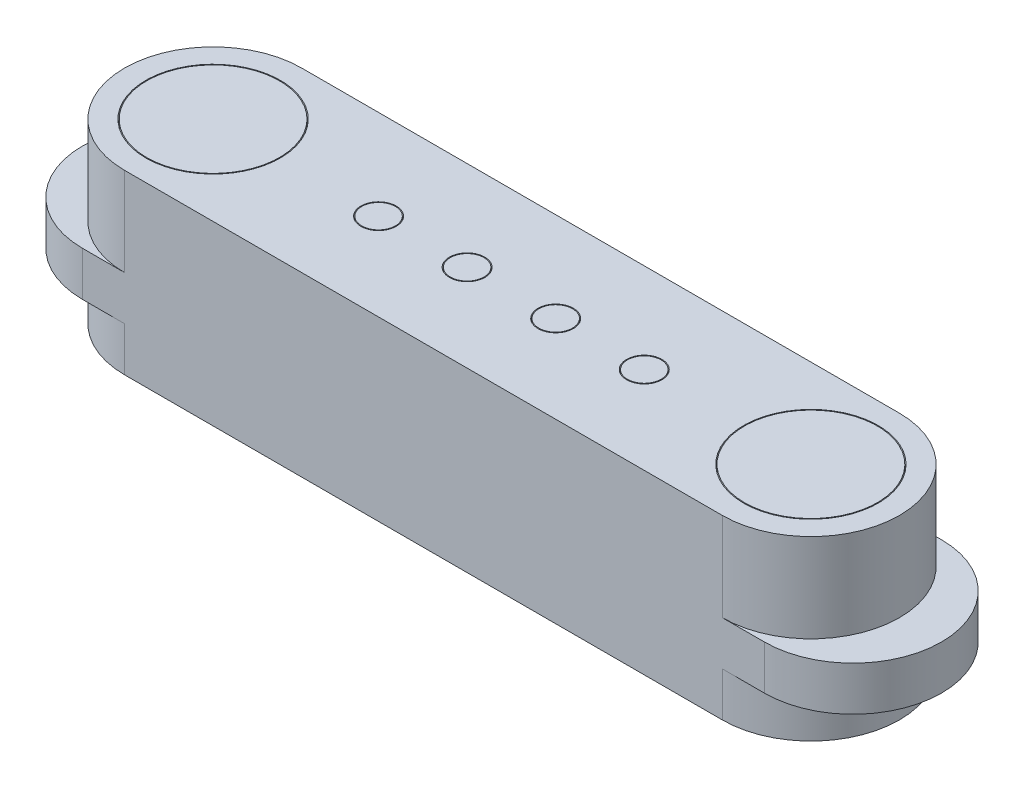
ISO-10303-21;
HEADER;
FILE_DESCRIPTION(('STEP AP214'),'2;1');
FILE_NAME('part.step','',(''),(''),'','','');
FILE_SCHEMA(('AUTOMOTIVE_DESIGN { 1 0 10303 214 1 1 1 1 }'));
ENDSEC;
DATA;
#1=APPLICATION_CONTEXT('core data for automotive mechanical design processes');
#2=APPLICATION_PROTOCOL_DEFINITION('international standard','automotive_design',2000,#1);
#3=PRODUCT_CONTEXT('',#1,'mechanical');
#4=PRODUCT('Part','Part','',(#3));
#5=PRODUCT_RELATED_PRODUCT_CATEGORY('part','',(#4));
#6=PRODUCT_DEFINITION_FORMATION('','',#4);
#7=PRODUCT_DEFINITION_CONTEXT('part definition',#1,'design');
#8=PRODUCT_DEFINITION('design','',#6,#7);
#9=PRODUCT_DEFINITION_SHAPE('','',#8);
#10=(LENGTH_UNIT() NAMED_UNIT(*) SI_UNIT(.MILLI.,.METRE.));
#11=(NAMED_UNIT(*) PLANE_ANGLE_UNIT() SI_UNIT($,.RADIAN.));
#12=(NAMED_UNIT(*) SI_UNIT($,.STERADIAN.) SOLID_ANGLE_UNIT());
#13=UNCERTAINTY_MEASURE_WITH_UNIT(LENGTH_MEASURE(1.E-05),#10,'distance_accuracy_value','');
#14=(GEOMETRIC_REPRESENTATION_CONTEXT(3) GLOBAL_UNCERTAINTY_ASSIGNED_CONTEXT((#13)) GLOBAL_UNIT_ASSIGNED_CONTEXT((#10,
#11,#12)) REPRESENTATION_CONTEXT('',''));
#15=CARTESIAN_POINT('',(0.,0.,0.));
#16=DIRECTION('',(0.,0.,1.));
#17=DIRECTION('',(1.,0.,0.));
#18=AXIS2_PLACEMENT_3D('',#15,#16,#17);
#19=CARTESIAN_POINT('',(-6.74999888260195,3.0073398695922,2.05848750448484E-06));
#20=DIRECTION('',(0.,-1.,0.));
#21=DIRECTION('',(0.,0.,-1.));
#22=AXIS2_PLACEMENT_3D('',#19,#20,#21);
#23=CYLINDRICAL_SURFACE('',#22,2.);
#24=CARTESIAN_POINT('',(-6.74999888260195,0.00733986959219955,2.05848750448484E-06));
#25=DIRECTION('',(0.,1.,0.));
#26=DIRECTION('',(0.,0.,1.));
#27=AXIS2_PLACEMENT_3D('',#24,#25,#26);
#28=CIRCLE('',#27,2.);
#29=CARTESIAN_POINT('',(-6.74999888260195,0.00733986959219955,-1.9999979415125));
#30=VERTEX_POINT('',#29);
#31=CARTESIAN_POINT('',(-6.74999888260195,0.00733986959219955,2.0000020584875));
#32=VERTEX_POINT('',#31);
#33=EDGE_CURVE('E161',#30,#32,#28,.T.);
#34=ORIENTED_EDGE('',*,*,#33,.F.);
#35=DIRECTION('',(0.,-1.,0.));
#36=VECTOR('',#35,1.);
#37=CARTESIAN_POINT('',(-6.74999888260195,3.0073398695922,-1.9999979415125));
#38=LINE('',#37,#36);
#39=CARTESIAN_POINT('',(-6.74999888260195,-0.9926601304078,-1.9999979415125));
#40=VERTEX_POINT('',#39);
#41=EDGE_CURVE('E231',#30,#40,#38,.T.);
#42=ORIENTED_EDGE('',*,*,#41,.T.);
#43=CARTESIAN_POINT('',(-6.74999888260195,-0.9926601304078,2.05848750448484E-06));
#44=DIRECTION('',(0.,1.,0.));
#45=DIRECTION('',(0.,0.,1.));
#46=AXIS2_PLACEMENT_3D('',#43,#44,#45);
#47=CIRCLE('',#46,2.);
#48=CARTESIAN_POINT('',(-6.74999888260195,-0.9926601304078,2.0000020584875));
#49=VERTEX_POINT('',#48);
#50=EDGE_CURVE('E216',#40,#49,#47,.T.);
#51=ORIENTED_EDGE('',*,*,#50,.T.);
#52=DIRECTION('',(0.,-1.,0.));
#53=VECTOR('',#52,1.);
#54=CARTESIAN_POINT('',(-6.74999888260195,3.0073398695922,2.0000020584875));
#55=LINE('',#54,#53);
#56=EDGE_CURVE('E62',#32,#49,#55,.T.);
#57=ORIENTED_EDGE('',*,*,#56,.F.);
#58=EDGE_LOOP('',(#34,#42,#51,#57));
#59=FACE_BOUND('',#58,.T.);
#60=ADVANCED_FACE('F53',(#59),#23,.T.);
#61=CARTESIAN_POINT('',(6.75000111739805,3.0073398695922,2.05848750200493E-06));
#62=DIRECTION('',(0.,-1.,0.));
#63=DIRECTION('',(0.,0.,-1.));
#64=AXIS2_PLACEMENT_3D('',#61,#62,#63);
#65=CYLINDRICAL_SURFACE('',#64,2.);
#66=CARTESIAN_POINT('',(6.75000111739805,0.00733986959219955,2.05848750200493E-06));
#67=DIRECTION('',(0.,1.,0.));
#68=DIRECTION('',(0.,0.,1.));
#69=AXIS2_PLACEMENT_3D('',#66,#67,#68);
#70=CIRCLE('',#69,2.);
#71=CARTESIAN_POINT('',(6.75000111739805,0.00733986959219955,2.0000020584875));
#72=VERTEX_POINT('',#71);
#73=CARTESIAN_POINT('',(6.75000111739805,0.00733986959219955,-1.9999979415125));
#74=VERTEX_POINT('',#73);
#75=EDGE_CURVE('E211',#72,#74,#70,.T.);
#76=ORIENTED_EDGE('',*,*,#75,.F.);
#77=DIRECTION('',(0.,-1.,0.));
#78=VECTOR('',#77,1.);
#79=CARTESIAN_POINT('',(6.75000111739805,3.0073398695922,2.0000020584875));
#80=LINE('',#79,#78);
#81=CARTESIAN_POINT('',(6.75000111739805,-0.9926601304078,2.0000020584875));
#82=VERTEX_POINT('',#81);
#83=EDGE_CURVE('E254',#72,#82,#80,.T.);
#84=ORIENTED_EDGE('',*,*,#83,.T.);
#85=CARTESIAN_POINT('',(6.75000111739805,-0.9926601304078,2.05848750200493E-06));
#86=DIRECTION('',(0.,1.,0.));
#87=DIRECTION('',(0.,0.,1.));
#88=AXIS2_PLACEMENT_3D('',#85,#86,#87);
#89=CIRCLE('',#88,2.);
#90=CARTESIAN_POINT('',(6.75000111739805,-0.9926601304078,-1.9999979415125));
#91=VERTEX_POINT('',#90);
#92=EDGE_CURVE('E239',#82,#91,#89,.T.);
#93=ORIENTED_EDGE('',*,*,#92,.T.);
#94=DIRECTION('',(0.,-1.,0.));
#95=VECTOR('',#94,1.);
#96=CARTESIAN_POINT('',(6.75000111739805,3.0073398695922,-1.9999979415125));
#97=LINE('',#96,#95);
#98=EDGE_CURVE('E250',#74,#91,#97,.T.);
#99=ORIENTED_EDGE('',*,*,#98,.F.);
#100=EDGE_LOOP('',(#76,#84,#93,#99));
#101=FACE_BOUND('',#100,.T.);
#102=ADVANCED_FACE('F266',(#101),#65,.T.);
#103=CARTESIAN_POINT('',(-6.74999888260195,3.0073398695922,-1.9999979415125));
#104=VERTEX_POINT('',#103);
#105=CARTESIAN_POINT('',(-6.74999888260195,1.0073398695922,-1.9999979415125));
#106=VERTEX_POINT('',#105);
#107=EDGE_CURVE('E246',#104,#106,#38,.T.);
#108=ORIENTED_EDGE('',*,*,#107,.T.);
#109=CARTESIAN_POINT('',(-6.74999888260195,1.0073398695922,2.05848750448484E-06));
#110=DIRECTION('',(0.,1.,0.));
#111=DIRECTION('',(0.,0.,1.));
#112=AXIS2_PLACEMENT_3D('',#109,#110,#111);
#113=CIRCLE('',#112,2.);
#114=CARTESIAN_POINT('',(-6.74999888260195,1.0073398695922,2.0000020584875));
#115=VERTEX_POINT('',#114);
#116=EDGE_CURVE('E208',#106,#115,#113,.T.);
#117=ORIENTED_EDGE('',*,*,#116,.T.);
#118=CARTESIAN_POINT('',(-6.74999888260195,3.0073398695922,2.0000020584875));
#119=VERTEX_POINT('',#118);
#120=EDGE_CURVE('E12',#119,#115,#55,.T.);
#121=ORIENTED_EDGE('',*,*,#120,.F.);
#122=CARTESIAN_POINT('',(-6.74999888260195,3.0073398695922,2.05848750448484E-06));
#123=DIRECTION('',(0.,1.,0.));
#124=DIRECTION('',(0.,0.,1.));
#125=AXIS2_PLACEMENT_3D('',#122,#123,#124);
#126=CIRCLE('',#125,2.);
#127=EDGE_CURVE('E217',#104,#119,#126,.T.);
#128=ORIENTED_EDGE('',*,*,#127,.F.);
#129=EDGE_LOOP('',(#108,#117,#121,#128));
#130=FACE_BOUND('',#129,.T.);
#131=ADVANCED_FACE('F55',(#130),#23,.T.);
#132=CARTESIAN_POINT('',(-6.74999888260195,3.0073398695922,2.0000020584875));
#133=DIRECTION('',(0.,0.,-1.));
#134=DIRECTION('',(-1.,0.,0.));
#135=AXIS2_PLACEMENT_3D('',#132,#133,#134);
#136=PLANE('',#135);
#137=ORIENTED_EDGE('',*,*,#120,.T.);
#138=DIRECTION('',(1.,0.,0.));
#139=VECTOR('',#138,1.);
#140=CARTESIAN_POINT('',(-7.69999888260195,1.0073398695922,2.0000020584875));
#141=LINE('',#140,#139);
#142=CARTESIAN_POINT('',(-7.69999888260195,1.0073398695922,2.0000020584875));
#143=VERTEX_POINT('',#142);
#144=EDGE_CURVE('E69',#143,#115,#141,.T.);
#145=ORIENTED_EDGE('',*,*,#144,.F.);
#146=DIRECTION('',(0.,1.,0.));
#147=VECTOR('',#146,1.);
#148=CARTESIAN_POINT('',(-7.69999888260195,0.00733986959219955,2.0000020584875));
#149=LINE('',#148,#147);
#150=CARTESIAN_POINT('',(-7.69999888260195,0.00733986959219955,2.0000020584875));
#151=VERTEX_POINT('',#150);
#152=EDGE_CURVE('E144',#151,#143,#149,.T.);
#153=ORIENTED_EDGE('',*,*,#152,.F.);
#154=DIRECTION('',(1.,0.,0.));
#155=VECTOR('',#154,1.);
#156=CARTESIAN_POINT('',(-7.69999888260195,0.00733986959219955,2.0000020584875));
#157=LINE('',#156,#155);
#158=EDGE_CURVE('E147',#151,#32,#157,.T.);
#159=ORIENTED_EDGE('',*,*,#158,.T.);
#160=ORIENTED_EDGE('',*,*,#56,.T.);
#161=DIRECTION('',(1.,0.,0.));
#162=VECTOR('',#161,1.);
#163=CARTESIAN_POINT('',(-6.74999888260195,-0.9926601304078,2.0000020584875));
#164=LINE('',#163,#162);
#165=EDGE_CURVE('E235',#49,#82,#164,.T.);
#166=ORIENTED_EDGE('',*,*,#165,.T.);
#167=ORIENTED_EDGE('',*,*,#83,.F.);
#168=CARTESIAN_POINT('',(7.70000111739805,0.00733986959219955,2.0000020584875));
#169=VERTEX_POINT('',#168);
#170=EDGE_CURVE('E164',#72,#169,#157,.T.);
#171=ORIENTED_EDGE('',*,*,#170,.T.);
#172=DIRECTION('',(0.,1.,0.));
#173=VECTOR('',#172,1.);
#174=CARTESIAN_POINT('',(7.70000111739805,0.00733986959219955,2.0000020584875));
#175=LINE('',#174,#173);
#176=CARTESIAN_POINT('',(7.70000111739805,1.0073398695922,2.0000020584875));
#177=VERTEX_POINT('',#176);
#178=EDGE_CURVE('E153',#169,#177,#175,.T.);
#179=ORIENTED_EDGE('',*,*,#178,.T.);
#180=CARTESIAN_POINT('',(6.75000111739805,1.0073398695922,2.0000020584875));
#181=VERTEX_POINT('',#180);
#182=EDGE_CURVE('E190',#181,#177,#141,.T.);
#183=ORIENTED_EDGE('',*,*,#182,.F.);
#184=CARTESIAN_POINT('',(6.75000111739805,3.0073398695922,2.0000020584875));
#185=VERTEX_POINT('',#184);
#186=EDGE_CURVE('E255',#185,#181,#80,.T.);
#187=ORIENTED_EDGE('',*,*,#186,.F.);
#188=DIRECTION('',(1.,0.,0.));
#189=VECTOR('',#188,1.);
#190=CARTESIAN_POINT('',(-6.74999888260195,3.0073398695922,2.0000020584875));
#191=LINE('',#190,#189);
#192=EDGE_CURVE('E221',#119,#185,#191,.T.);
#193=ORIENTED_EDGE('',*,*,#192,.F.);
#194=EDGE_LOOP('',(#137,#145,#153,#159,#160,#166,#167,#171,#179,#183,#187,#193));
#195=FACE_BOUND('',#194,.T.);
#196=ADVANCED_FACE('F146',(#195),#136,.F.);
#197=ORIENTED_EDGE('',*,*,#186,.T.);
#198=CARTESIAN_POINT('',(6.75000111739805,1.0073398695922,2.05848750200493E-06));
#199=DIRECTION('',(0.,1.,0.));
#200=DIRECTION('',(0.,0.,1.));
#201=AXIS2_PLACEMENT_3D('',#198,#199,#200);
#202=CIRCLE('',#201,2.);
#203=CARTESIAN_POINT('',(6.75000111739805,1.0073398695922,-1.9999979415125));
#204=VERTEX_POINT('',#203);
#205=EDGE_CURVE('E199',#181,#204,#202,.T.);
#206=ORIENTED_EDGE('',*,*,#205,.T.);
#207=CARTESIAN_POINT('',(6.75000111739805,3.0073398695922,-1.9999979415125));
#208=VERTEX_POINT('',#207);
#209=EDGE_CURVE('E251',#208,#204,#97,.T.);
#210=ORIENTED_EDGE('',*,*,#209,.F.);
#211=CARTESIAN_POINT('',(6.75000111739805,3.0073398695922,2.05848750200493E-06));
#212=DIRECTION('',(0.,1.,0.));
#213=DIRECTION('',(0.,0.,1.));
#214=AXIS2_PLACEMENT_3D('',#211,#212,#213);
#215=CIRCLE('',#214,2.);
#216=EDGE_CURVE('E225',#185,#208,#215,.T.);
#217=ORIENTED_EDGE('',*,*,#216,.F.);
#218=EDGE_LOOP('',(#197,#206,#210,#217));
#219=FACE_BOUND('',#218,.T.);
#220=ADVANCED_FACE('F288',(#219),#65,.T.);
#221=CARTESIAN_POINT('',(-6.74999888260195,3.0073398695922,-1.9999979415125));
#222=DIRECTION('',(0.,0.,1.));
#223=DIRECTION('',(1.,0.,0.));
#224=AXIS2_PLACEMENT_3D('',#221,#222,#223);
#225=PLANE('',#224);
#226=ORIENTED_EDGE('',*,*,#209,.T.);
#227=DIRECTION('',(-1.,0.,0.));
#228=VECTOR('',#227,1.);
#229=CARTESIAN_POINT('',(-7.69999888260195,1.0073398695922,-1.9999979415125));
#230=LINE('',#229,#228);
#231=CARTESIAN_POINT('',(7.70000111739805,1.0073398695922,-1.9999979415125));
#232=VERTEX_POINT('',#231);
#233=EDGE_CURVE('E77',#232,#204,#230,.T.);
#234=ORIENTED_EDGE('',*,*,#233,.F.);
#235=DIRECTION('',(0.,1.,0.));
#236=VECTOR('',#235,1.);
#237=CARTESIAN_POINT('',(7.70000111739805,0.00733986959219955,-1.9999979415125));
#238=LINE('',#237,#236);
#239=CARTESIAN_POINT('',(7.70000111739805,0.00733986959219955,-1.9999979415125));
#240=VERTEX_POINT('',#239);
#241=EDGE_CURVE('E200',#240,#232,#238,.T.);
#242=ORIENTED_EDGE('',*,*,#241,.F.);
#243=DIRECTION('',(-1.,0.,0.));
#244=VECTOR('',#243,1.);
#245=CARTESIAN_POINT('',(-7.69999888260195,0.00733986959219955,-1.9999979415125));
#246=LINE('',#245,#244);
#247=EDGE_CURVE('E154',#240,#74,#246,.T.);
#248=ORIENTED_EDGE('',*,*,#247,.T.);
#249=ORIENTED_EDGE('',*,*,#98,.T.);
#250=DIRECTION('',(-1.,0.,0.));
#251=VECTOR('',#250,1.);
#252=CARTESIAN_POINT('',(-6.74999888260195,-0.9926601304078,-1.9999979415125));
#253=LINE('',#252,#251);
#254=EDGE_CURVE('E222',#91,#40,#253,.T.);
#255=ORIENTED_EDGE('',*,*,#254,.T.);
#256=ORIENTED_EDGE('',*,*,#41,.F.);
#257=CARTESIAN_POINT('',(-7.69999888260195,0.00733986959219955,-1.9999979415125));
#258=VERTEX_POINT('',#257);
#259=EDGE_CURVE('E183',#30,#258,#246,.T.);
#260=ORIENTED_EDGE('',*,*,#259,.T.);
#261=DIRECTION('',(0.,1.,0.));
#262=VECTOR('',#261,1.);
#263=CARTESIAN_POINT('',(-7.69999888260195,0.00733986959219955,-1.9999979415125));
#264=LINE('',#263,#262);
#265=CARTESIAN_POINT('',(-7.69999888260195,1.0073398695922,-1.9999979415125));
#266=VERTEX_POINT('',#265);
#267=EDGE_CURVE('E169',#258,#266,#264,.T.);
#268=ORIENTED_EDGE('',*,*,#267,.T.);
#269=EDGE_CURVE('E174',#106,#266,#230,.T.);
#270=ORIENTED_EDGE('',*,*,#269,.F.);
#271=ORIENTED_EDGE('',*,*,#107,.F.);
#272=DIRECTION('',(-1.,0.,0.));
#273=VECTOR('',#272,1.);
#274=CARTESIAN_POINT('',(-6.74999888260195,3.0073398695922,-1.9999979415125));
#275=LINE('',#274,#273);
#276=EDGE_CURVE('E228',#208,#104,#275,.T.);
#277=ORIENTED_EDGE('',*,*,#276,.F.);
#278=EDGE_LOOP('',(#226,#234,#242,#248,#249,#255,#256,#260,#268,#270,#271,#277));
#279=FACE_BOUND('',#278,.T.);
#280=ADVANCED_FACE('F276',(#279),#225,.F.);
#281=CARTESIAN_POINT('',(-6.74999888260195,3.0073398695922,2.05848750448484E-06));
#282=DIRECTION('',(0.,1.,0.));
#283=DIRECTION('',(0.,0.,1.));
#284=AXIS2_PLACEMENT_3D('',#281,#282,#283);
#285=PLANE('',#284);
#286=CARTESIAN_POINT('',(-6.74999888260194,3.0073398695922,2.05848750448484E-06));
#287=DIRECTION('',(0.,1.,0.));
#288=DIRECTION('',(0.,0.,1.));
#289=AXIS2_PLACEMENT_3D('',#286,#287,#288);
#290=CIRCLE('',#289,1.52);
#291=CARTESIAN_POINT('',(-6.74999888260194,3.0073398695922,1.5200020584875));
#292=VERTEX_POINT('',#291);
#293=EDGE_CURVE('E303',#292,#292,#290,.T.);
#294=ORIENTED_EDGE('',*,*,#293,.F.);
#295=EDGE_LOOP('',(#294));
#296=FACE_BOUND('',#295,.T.);
#297=CARTESIAN_POINT('',(-2.9843699636731,3.0073398695922,0.0287938880903043));
#298=DIRECTION('',(0.,1.,0.));
#299=DIRECTION('',(0.,0.,1.));
#300=AXIS2_PLACEMENT_3D('',#297,#298,#299);
#301=CIRCLE('',#300,0.399371301177034);
#302=CARTESIAN_POINT('',(-2.9843699636731,3.0073398695922,0.428165189267338));
#303=VERTEX_POINT('',#302);
#304=EDGE_CURVE('E323',#303,#303,#301,.T.);
#305=ORIENTED_EDGE('',*,*,#304,.F.);
#306=EDGE_LOOP('',(#305));
#307=FACE_BOUND('',#306,.T.);
#308=CARTESIAN_POINT('',(-0.984369963673101,3.0073398695922,0.0287938880903043));
#309=DIRECTION('',(0.,1.,0.));
#310=DIRECTION('',(0.,0.,1.));
#311=AXIS2_PLACEMENT_3D('',#308,#309,#310);
#312=CIRCLE('',#311,0.399371301177034);
#313=CARTESIAN_POINT('',(-0.984369963673101,3.0073398695922,0.428165189267338));
#314=VERTEX_POINT('',#313);
#315=EDGE_CURVE('E339',#314,#314,#312,.T.);
#316=ORIENTED_EDGE('',*,*,#315,.F.);
#317=EDGE_LOOP('',(#316));
#318=FACE_BOUND('',#317,.T.);
#319=CARTESIAN_POINT('',(1.0156300363269,3.0073398695922,0.0287938880903043));
#320=DIRECTION('',(0.,1.,0.));
#321=DIRECTION('',(0.,0.,1.));
#322=AXIS2_PLACEMENT_3D('',#319,#320,#321);
#323=CIRCLE('',#322,0.399371301177034);
#324=CARTESIAN_POINT('',(1.0156300363269,3.0073398695922,0.428165189267338));
#325=VERTEX_POINT('',#324);
#326=EDGE_CURVE('E355',#325,#325,#323,.T.);
#327=ORIENTED_EDGE('',*,*,#326,.F.);
#328=EDGE_LOOP('',(#327));
#329=FACE_BOUND('',#328,.T.);
#330=CARTESIAN_POINT('',(3.0156300363269,3.0073398695922,0.0287938880903043));
#331=DIRECTION('',(0.,1.,0.));
#332=DIRECTION('',(0.,0.,1.));
#333=AXIS2_PLACEMENT_3D('',#330,#331,#332);
#334=CIRCLE('',#333,0.399371301177034);
#335=CARTESIAN_POINT('',(3.0156300363269,3.0073398695922,0.428165189267338));
#336=VERTEX_POINT('',#335);
#337=EDGE_CURVE('E371',#336,#336,#334,.T.);
#338=ORIENTED_EDGE('',*,*,#337,.F.);
#339=EDGE_LOOP('',(#338));
#340=FACE_BOUND('',#339,.T.);
#341=CARTESIAN_POINT('',(6.75000111739805,3.0073398695922,2.05848750188276E-06));
#342=DIRECTION('',(0.,1.,0.));
#343=DIRECTION('',(0.,0.,1.));
#344=AXIS2_PLACEMENT_3D('',#341,#342,#343);
#345=CIRCLE('',#344,1.52);
#346=CARTESIAN_POINT('',(6.75000111739805,3.0073398695922,1.5200020584875));
#347=VERTEX_POINT('',#346);
#348=EDGE_CURVE('E385',#347,#347,#345,.T.);
#349=ORIENTED_EDGE('',*,*,#348,.F.);
#350=EDGE_LOOP('',(#349));
#351=FACE_BOUND('',#350,.T.);
#352=ORIENTED_EDGE('',*,*,#127,.T.);
#353=ORIENTED_EDGE('',*,*,#192,.T.);
#354=ORIENTED_EDGE('',*,*,#216,.T.);
#355=ORIENTED_EDGE('',*,*,#276,.T.);
#356=EDGE_LOOP('',(#352,#353,#354,#355));
#357=FACE_BOUND('',#356,.T.);
#358=ADVANCED_FACE('F402',(#296,#307,#318,#329,#340,#351,#357),#285,.T.);
#359=CARTESIAN_POINT('',(-6.74999888260195,-0.9926601304078,2.05848750448484E-06));
#360=DIRECTION('',(0.,1.,0.));
#361=DIRECTION('',(0.,0.,1.));
#362=AXIS2_PLACEMENT_3D('',#359,#360,#361);
#363=PLANE('',#362);
#364=ORIENTED_EDGE('',*,*,#50,.F.);
#365=ORIENTED_EDGE('',*,*,#254,.F.);
#366=ORIENTED_EDGE('',*,*,#92,.F.);
#367=ORIENTED_EDGE('',*,*,#165,.F.);
#368=EDGE_LOOP('',(#364,#365,#366,#367));
#369=FACE_BOUND('',#368,.T.);
#370=ADVANCED_FACE('F273',(#369),#363,.F.);
#371=CARTESIAN_POINT('',(7.70000111739805,0.00733986959219955,2.05848750448484E-06));
#372=DIRECTION('',(0.,1.,0.));
#373=DIRECTION('',(0.,0.,1.));
#374=AXIS2_PLACEMENT_3D('',#371,#372,#373);
#375=CYLINDRICAL_SURFACE('',#374,2.);
#376=CARTESIAN_POINT('',(7.70000111739805,1.0073398695922,2.05848750448484E-06));
#377=DIRECTION('',(0.,1.,0.));
#378=DIRECTION('',(0.,0.,1.));
#379=AXIS2_PLACEMENT_3D('',#376,#377,#378);
#380=CIRCLE('',#379,2.);
#381=EDGE_CURVE('E194',#177,#232,#380,.T.);
#382=ORIENTED_EDGE('',*,*,#381,.F.);
#383=ORIENTED_EDGE('',*,*,#178,.F.);
#384=CARTESIAN_POINT('',(7.70000111739805,0.00733986959219955,2.05848750448484E-06));
#385=DIRECTION('',(0.,1.,0.));
#386=DIRECTION('',(0.,0.,1.));
#387=AXIS2_PLACEMENT_3D('',#384,#385,#386);
#388=CIRCLE('',#387,2.);
#389=EDGE_CURVE('E163',#169,#240,#388,.T.);
#390=ORIENTED_EDGE('',*,*,#389,.T.);
#391=ORIENTED_EDGE('',*,*,#241,.T.);
#392=EDGE_LOOP('',(#382,#383,#390,#391));
#393=FACE_BOUND('',#392,.T.);
#394=ADVANCED_FACE('F415',(#393),#375,.T.);
#395=CARTESIAN_POINT('',(-7.69999888260195,0.00733986959219955,2.05848750448484E-06));
#396=DIRECTION('',(0.,1.,0.));
#397=DIRECTION('',(0.,0.,1.));
#398=AXIS2_PLACEMENT_3D('',#395,#396,#397);
#399=PLANE('',#398);
#400=ORIENTED_EDGE('',*,*,#170,.F.);
#401=ORIENTED_EDGE('',*,*,#75,.T.);
#402=ORIENTED_EDGE('',*,*,#247,.F.);
#403=ORIENTED_EDGE('',*,*,#389,.F.);
#404=EDGE_LOOP('',(#400,#401,#402,#403));
#405=FACE_BOUND('',#404,.T.);
#406=ADVANCED_FACE('F417',(#405),#399,.F.);
#407=CARTESIAN_POINT('',(-7.69999888260195,1.0073398695922,2.05848750448484E-06));
#408=DIRECTION('',(0.,1.,0.));
#409=DIRECTION('',(0.,0.,1.));
#410=AXIS2_PLACEMENT_3D('',#407,#408,#409);
#411=PLANE('',#410);
#412=ORIENTED_EDGE('',*,*,#205,.F.);
#413=ORIENTED_EDGE('',*,*,#182,.T.);
#414=ORIENTED_EDGE('',*,*,#381,.T.);
#415=ORIENTED_EDGE('',*,*,#233,.T.);
#416=EDGE_LOOP('',(#412,#413,#414,#415));
#417=FACE_BOUND('',#416,.T.);
#418=ADVANCED_FACE('F418',(#417),#411,.T.);
#419=ORIENTED_EDGE('',*,*,#259,.F.);
#420=ORIENTED_EDGE('',*,*,#33,.T.);
#421=ORIENTED_EDGE('',*,*,#158,.F.);
#422=CARTESIAN_POINT('',(-7.69999888260195,0.00733986959219955,2.05848750448484E-06));
#423=DIRECTION('',(0.,1.,0.));
#424=DIRECTION('',(0.,0.,1.));
#425=AXIS2_PLACEMENT_3D('',#422,#423,#424);
#426=CIRCLE('',#425,2.);
#427=EDGE_CURVE('E159',#258,#151,#426,.T.);
#428=ORIENTED_EDGE('',*,*,#427,.F.);
#429=EDGE_LOOP('',(#419,#420,#421,#428));
#430=FACE_BOUND('',#429,.T.);
#431=ADVANCED_FACE('F158',(#430),#399,.F.);
#432=ORIENTED_EDGE('',*,*,#116,.F.);
#433=ORIENTED_EDGE('',*,*,#269,.T.);
#434=CARTESIAN_POINT('',(-7.69999888260195,1.0073398695922,2.05848750448484E-06));
#435=DIRECTION('',(0.,1.,0.));
#436=DIRECTION('',(0.,0.,1.));
#437=AXIS2_PLACEMENT_3D('',#434,#435,#436);
#438=CIRCLE('',#437,2.);
#439=EDGE_CURVE('E187',#266,#143,#438,.T.);
#440=ORIENTED_EDGE('',*,*,#439,.T.);
#441=ORIENTED_EDGE('',*,*,#144,.T.);
#442=EDGE_LOOP('',(#432,#433,#440,#441));
#443=FACE_BOUND('',#442,.T.);
#444=ADVANCED_FACE('F421',(#443),#411,.T.);
#445=CARTESIAN_POINT('',(-7.69999888260195,0.00733986959219955,2.05848750448484E-06));
#446=DIRECTION('',(0.,1.,0.));
#447=DIRECTION('',(0.,0.,1.));
#448=AXIS2_PLACEMENT_3D('',#445,#446,#447);
#449=CYLINDRICAL_SURFACE('',#448,2.);
#450=ORIENTED_EDGE('',*,*,#439,.F.);
#451=ORIENTED_EDGE('',*,*,#267,.F.);
#452=ORIENTED_EDGE('',*,*,#427,.T.);
#453=ORIENTED_EDGE('',*,*,#152,.T.);
#454=EDGE_LOOP('',(#450,#451,#452,#453));
#455=FACE_BOUND('',#454,.T.);
#456=ADVANCED_FACE('F167',(#455),#449,.T.);
#457=CARTESIAN_POINT('',(6.75000111739805,2.8073398695922,2.05848750188276E-06));
#458=DIRECTION('',(0.,1.,0.));
#459=DIRECTION('',(0.,0.,1.));
#460=AXIS2_PLACEMENT_3D('',#457,#458,#459);
#461=CYLINDRICAL_SURFACE('',#460,1.52);
#462=CARTESIAN_POINT('',(6.75000111739805,2.8073398695922,2.05848750188276E-06));
#463=DIRECTION('',(0.,1.,0.));
#464=DIRECTION('',(0.,0.,1.));
#465=AXIS2_PLACEMENT_3D('',#462,#463,#464);
#466=CIRCLE('',#465,1.52);
#467=CARTESIAN_POINT('',(6.75000111739805,2.8073398695922,1.5200020584875));
#468=VERTEX_POINT('',#467);
#469=EDGE_CURVE('E388',#468,#468,#466,.T.);
#470=ORIENTED_EDGE('',*,*,#469,.F.);
#471=EDGE_LOOP('',(#470));
#472=FACE_BOUND('',#471,.T.);
#473=ORIENTED_EDGE('',*,*,#348,.T.);
#474=EDGE_LOOP('',(#473));
#475=FACE_BOUND('',#474,.T.);
#476=ADVANCED_FACE('F396',(#472,#475),#461,.F.);
#477=CARTESIAN_POINT('',(6.75000111739805,2.8073398695922,2.05848750188276E-06));
#478=DIRECTION('',(0.,1.,0.));
#479=DIRECTION('',(0.,0.,1.));
#480=AXIS2_PLACEMENT_3D('',#477,#478,#479);
#481=PLANE('',#480);
#482=CARTESIAN_POINT('',(6.75000111739805,2.8073398695922,2.05848750188276E-06));
#483=DIRECTION('',(0.,1.,0.));
#484=DIRECTION('',(0.,0.,1.));
#485=AXIS2_PLACEMENT_3D('',#482,#483,#484);
#486=CIRCLE('',#485,1.5);
#487=CARTESIAN_POINT('',(6.75000111739805,2.8073398695922,1.5000020584875));
#488=VERTEX_POINT('',#487);
#489=EDGE_CURVE('E177',#488,#488,#486,.T.);
#490=ORIENTED_EDGE('',*,*,#489,.F.);
#491=EDGE_LOOP('',(#490));
#492=FACE_BOUND('',#491,.T.);
#493=ORIENTED_EDGE('',*,*,#469,.T.);
#494=EDGE_LOOP('',(#493));
#495=FACE_BOUND('',#494,.T.);
#496=ADVANCED_FACE('F394',(#492,#495),#481,.T.);
#497=CARTESIAN_POINT('',(6.75000111739805,2.8073398695922,2.05848750188276E-06));
#498=DIRECTION('',(0.,1.,0.));
#499=DIRECTION('',(0.,0.,1.));
#500=AXIS2_PLACEMENT_3D('',#497,#498,#499);
#501=CYLINDRICAL_SURFACE('',#500,1.5);
#502=ORIENTED_EDGE('',*,*,#489,.T.);
#503=EDGE_LOOP('',(#502));
#504=FACE_BOUND('',#503,.T.);
#505=CARTESIAN_POINT('',(6.75000111739805,3.0073398695922,2.05848750188276E-06));
#506=DIRECTION('',(0.,1.,0.));
#507=DIRECTION('',(0.,0.,1.));
#508=AXIS2_PLACEMENT_3D('',#505,#506,#507);
#509=CIRCLE('',#508,1.5);
#510=CARTESIAN_POINT('',(6.75000111739805,3.0073398695922,1.5000020584875));
#511=VERTEX_POINT('',#510);
#512=EDGE_CURVE('E379',#511,#511,#509,.T.);
#513=ORIENTED_EDGE('',*,*,#512,.F.);
#514=EDGE_LOOP('',(#513));
#515=FACE_BOUND('',#514,.T.);
#516=ADVANCED_FACE('F671',(#504,#515),#501,.T.);
#517=CARTESIAN_POINT('',(3.0156300363269,2.8073398695922,0.0287938880903043));
#518=DIRECTION('',(0.,1.,0.));
#519=DIRECTION('',(0.,0.,1.));
#520=AXIS2_PLACEMENT_3D('',#517,#518,#519);
#521=CYLINDRICAL_SURFACE('',#520,0.399371301177034);
#522=CARTESIAN_POINT('',(3.0156300363269,2.8073398695922,0.0287938880903043));
#523=DIRECTION('',(0.,1.,0.));
#524=DIRECTION('',(0.,0.,1.));
#525=AXIS2_PLACEMENT_3D('',#522,#523,#524);
#526=CIRCLE('',#525,0.399371301177034);
#527=CARTESIAN_POINT('',(3.0156300363269,2.8073398695922,0.428165189267338));
#528=VERTEX_POINT('',#527);
#529=EDGE_CURVE('E375',#528,#528,#526,.T.);
#530=ORIENTED_EDGE('',*,*,#529,.F.);
#531=EDGE_LOOP('',(#530));
#532=FACE_BOUND('',#531,.T.);
#533=ORIENTED_EDGE('',*,*,#337,.T.);
#534=EDGE_LOOP('',(#533));
#535=FACE_BOUND('',#534,.T.);
#536=ADVANCED_FACE('F666',(#532,#535),#521,.F.);
#537=CARTESIAN_POINT('',(3.0156300363269,2.8073398695922,0.0287938880903043));
#538=DIRECTION('',(0.,1.,0.));
#539=DIRECTION('',(0.,0.,1.));
#540=AXIS2_PLACEMENT_3D('',#537,#538,#539);
#541=PLANE('',#540);
#542=CARTESIAN_POINT('',(3.0156300363269,2.8073398695922,0.0287938880903043));
#543=DIRECTION('',(0.,1.,0.));
#544=DIRECTION('',(0.,0.,1.));
#545=AXIS2_PLACEMENT_3D('',#542,#543,#544);
#546=CIRCLE('',#545,0.379371301177034);
#547=CARTESIAN_POINT('',(3.0156300363269,2.8073398695922,0.408165189267339));
#548=VERTEX_POINT('',#547);
#549=EDGE_CURVE('E367',#548,#548,#546,.T.);
#550=ORIENTED_EDGE('',*,*,#549,.F.);
#551=EDGE_LOOP('',(#550));
#552=FACE_BOUND('',#551,.T.);
#553=ORIENTED_EDGE('',*,*,#529,.T.);
#554=EDGE_LOOP('',(#553));
#555=FACE_BOUND('',#554,.T.);
#556=ADVANCED_FACE('F670',(#552,#555),#541,.T.);
#557=CARTESIAN_POINT('',(3.0156300363269,2.8073398695922,0.0287938880903043));
#558=DIRECTION('',(0.,1.,0.));
#559=DIRECTION('',(0.,0.,1.));
#560=AXIS2_PLACEMENT_3D('',#557,#558,#559);
#561=CYLINDRICAL_SURFACE('',#560,0.379371301177034);
#562=ORIENTED_EDGE('',*,*,#549,.T.);
#563=EDGE_LOOP('',(#562));
#564=FACE_BOUND('',#563,.T.);
#565=CARTESIAN_POINT('',(3.0156300363269,3.0073398695922,0.0287938880903043));
#566=DIRECTION('',(0.,1.,0.));
#567=DIRECTION('',(0.,0.,1.));
#568=AXIS2_PLACEMENT_3D('',#565,#566,#567);
#569=CIRCLE('',#568,0.379371301177034);
#570=CARTESIAN_POINT('',(3.0156300363269,3.0073398695922,0.408165189267339));
#571=VERTEX_POINT('',#570);
#572=EDGE_CURVE('E363',#571,#571,#569,.T.);
#573=ORIENTED_EDGE('',*,*,#572,.F.);
#574=EDGE_LOOP('',(#573));
#575=FACE_BOUND('',#574,.T.);
#576=ADVANCED_FACE('F641',(#564,#575),#561,.T.);
#577=CARTESIAN_POINT('',(1.0156300363269,2.8073398695922,0.0287938880903043));
#578=DIRECTION('',(0.,1.,0.));
#579=DIRECTION('',(0.,0.,1.));
#580=AXIS2_PLACEMENT_3D('',#577,#578,#579);
#581=CYLINDRICAL_SURFACE('',#580,0.399371301177034);
#582=CARTESIAN_POINT('',(1.0156300363269,2.8073398695922,0.0287938880903043));
#583=DIRECTION('',(0.,1.,0.));
#584=DIRECTION('',(0.,0.,1.));
#585=AXIS2_PLACEMENT_3D('',#582,#583,#584);
#586=CIRCLE('',#585,0.399371301177034);
#587=CARTESIAN_POINT('',(1.0156300363269,2.8073398695922,0.428165189267338));
#588=VERTEX_POINT('',#587);
#589=EDGE_CURVE('E359',#588,#588,#586,.T.);
#590=ORIENTED_EDGE('',*,*,#589,.F.);
#591=EDGE_LOOP('',(#590));
#592=FACE_BOUND('',#591,.T.);
#593=ORIENTED_EDGE('',*,*,#326,.T.);
#594=EDGE_LOOP('',(#593));
#595=FACE_BOUND('',#594,.T.);
#596=ADVANCED_FACE('F636',(#592,#595),#581,.F.);
#597=CARTESIAN_POINT('',(1.0156300363269,2.8073398695922,0.0287938880903043));
#598=DIRECTION('',(0.,1.,0.));
#599=DIRECTION('',(0.,0.,1.));
#600=AXIS2_PLACEMENT_3D('',#597,#598,#599);
#601=PLANE('',#600);
#602=CARTESIAN_POINT('',(1.0156300363269,2.8073398695922,0.0287938880903043));
#603=DIRECTION('',(0.,1.,0.));
#604=DIRECTION('',(0.,0.,1.));
#605=AXIS2_PLACEMENT_3D('',#602,#603,#604);
#606=CIRCLE('',#605,0.379371301177034);
#607=CARTESIAN_POINT('',(1.0156300363269,2.8073398695922,0.408165189267339));
#608=VERTEX_POINT('',#607);
#609=EDGE_CURVE('E351',#608,#608,#606,.T.);
#610=ORIENTED_EDGE('',*,*,#609,.F.);
#611=EDGE_LOOP('',(#610));
#612=FACE_BOUND('',#611,.T.);
#613=ORIENTED_EDGE('',*,*,#589,.T.);
#614=EDGE_LOOP('',(#613));
#615=FACE_BOUND('',#614,.T.);
#616=ADVANCED_FACE('F640',(#612,#615),#601,.T.);
#617=CARTESIAN_POINT('',(1.0156300363269,2.8073398695922,0.0287938880903043));
#618=DIRECTION('',(0.,1.,0.));
#619=DIRECTION('',(0.,0.,1.));
#620=AXIS2_PLACEMENT_3D('',#617,#618,#619);
#621=CYLINDRICAL_SURFACE('',#620,0.379371301177034);
#622=ORIENTED_EDGE('',*,*,#609,.T.);
#623=EDGE_LOOP('',(#622));
#624=FACE_BOUND('',#623,.T.);
#625=CARTESIAN_POINT('',(1.0156300363269,3.0073398695922,0.0287938880903043));
#626=DIRECTION('',(0.,1.,0.));
#627=DIRECTION('',(0.,0.,1.));
#628=AXIS2_PLACEMENT_3D('',#625,#626,#627);
#629=CIRCLE('',#628,0.379371301177034);
#630=CARTESIAN_POINT('',(1.0156300363269,3.0073398695922,0.408165189267339));
#631=VERTEX_POINT('',#630);
#632=EDGE_CURVE('E347',#631,#631,#629,.T.);
#633=ORIENTED_EDGE('',*,*,#632,.F.);
#634=EDGE_LOOP('',(#633));
#635=FACE_BOUND('',#634,.T.);
#636=ADVANCED_FACE('F611',(#624,#635),#621,.T.);
#637=CARTESIAN_POINT('',(-0.984369963673101,2.8073398695922,0.0287938880903043));
#638=DIRECTION('',(0.,1.,0.));
#639=DIRECTION('',(0.,0.,1.));
#640=AXIS2_PLACEMENT_3D('',#637,#638,#639);
#641=CYLINDRICAL_SURFACE('',#640,0.399371301177034);
#642=CARTESIAN_POINT('',(-0.984369963673101,2.8073398695922,0.0287938880903043));
#643=DIRECTION('',(0.,1.,0.));
#644=DIRECTION('',(0.,0.,1.));
#645=AXIS2_PLACEMENT_3D('',#642,#643,#644);
#646=CIRCLE('',#645,0.399371301177034);
#647=CARTESIAN_POINT('',(-0.984369963673101,2.8073398695922,0.428165189267338));
#648=VERTEX_POINT('',#647);
#649=EDGE_CURVE('E343',#648,#648,#646,.T.);
#650=ORIENTED_EDGE('',*,*,#649,.F.);
#651=EDGE_LOOP('',(#650));
#652=FACE_BOUND('',#651,.T.);
#653=ORIENTED_EDGE('',*,*,#315,.T.);
#654=EDGE_LOOP('',(#653));
#655=FACE_BOUND('',#654,.T.);
#656=ADVANCED_FACE('F606',(#652,#655),#641,.F.);
#657=CARTESIAN_POINT('',(-0.984369963673101,2.8073398695922,0.0287938880903043));
#658=DIRECTION('',(0.,1.,0.));
#659=DIRECTION('',(0.,0.,1.));
#660=AXIS2_PLACEMENT_3D('',#657,#658,#659);
#661=PLANE('',#660);
#662=CARTESIAN_POINT('',(-0.984369963673101,2.8073398695922,0.0287938880903043));
#663=DIRECTION('',(0.,1.,0.));
#664=DIRECTION('',(0.,0.,1.));
#665=AXIS2_PLACEMENT_3D('',#662,#663,#664);
#666=CIRCLE('',#665,0.379371301177034);
#667=CARTESIAN_POINT('',(-0.984369963673101,2.8073398695922,0.408165189267339));
#668=VERTEX_POINT('',#667);
#669=EDGE_CURVE('E335',#668,#668,#666,.T.);
#670=ORIENTED_EDGE('',*,*,#669,.F.);
#671=EDGE_LOOP('',(#670));
#672=FACE_BOUND('',#671,.T.);
#673=ORIENTED_EDGE('',*,*,#649,.T.);
#674=EDGE_LOOP('',(#673));
#675=FACE_BOUND('',#674,.T.);
#676=ADVANCED_FACE('F610',(#672,#675),#661,.T.);
#677=CARTESIAN_POINT('',(-0.984369963673101,2.8073398695922,0.0287938880903043));
#678=DIRECTION('',(0.,1.,0.));
#679=DIRECTION('',(0.,0.,1.));
#680=AXIS2_PLACEMENT_3D('',#677,#678,#679);
#681=CYLINDRICAL_SURFACE('',#680,0.379371301177034);
#682=ORIENTED_EDGE('',*,*,#669,.T.);
#683=EDGE_LOOP('',(#682));
#684=FACE_BOUND('',#683,.T.);
#685=CARTESIAN_POINT('',(-0.984369963673101,3.0073398695922,0.0287938880903043));
#686=DIRECTION('',(0.,1.,0.));
#687=DIRECTION('',(0.,0.,1.));
#688=AXIS2_PLACEMENT_3D('',#685,#686,#687);
#689=CIRCLE('',#688,0.379371301177034);
#690=CARTESIAN_POINT('',(-0.984369963673101,3.0073398695922,0.408165189267339));
#691=VERTEX_POINT('',#690);
#692=EDGE_CURVE('E331',#691,#691,#689,.T.);
#693=ORIENTED_EDGE('',*,*,#692,.F.);
#694=EDGE_LOOP('',(#693));
#695=FACE_BOUND('',#694,.T.);
#696=ADVANCED_FACE('F581',(#684,#695),#681,.T.);
#697=CARTESIAN_POINT('',(-2.9843699636731,2.8073398695922,0.0287938880903043));
#698=DIRECTION('',(0.,1.,0.));
#699=DIRECTION('',(0.,0.,1.));
#700=AXIS2_PLACEMENT_3D('',#697,#698,#699);
#701=CYLINDRICAL_SURFACE('',#700,0.399371301177034);
#702=CARTESIAN_POINT('',(-2.9843699636731,2.8073398695922,0.0287938880903043));
#703=DIRECTION('',(0.,1.,0.));
#704=DIRECTION('',(0.,0.,1.));
#705=AXIS2_PLACEMENT_3D('',#702,#703,#704);
#706=CIRCLE('',#705,0.399371301177034);
#707=CARTESIAN_POINT('',(-2.9843699636731,2.8073398695922,0.428165189267338));
#708=VERTEX_POINT('',#707);
#709=EDGE_CURVE('E327',#708,#708,#706,.T.);
#710=ORIENTED_EDGE('',*,*,#709,.F.);
#711=EDGE_LOOP('',(#710));
#712=FACE_BOUND('',#711,.T.);
#713=ORIENTED_EDGE('',*,*,#304,.T.);
#714=EDGE_LOOP('',(#713));
#715=FACE_BOUND('',#714,.T.);
#716=ADVANCED_FACE('F576',(#712,#715),#701,.F.);
#717=CARTESIAN_POINT('',(-2.9843699636731,2.8073398695922,0.0287938880903043));
#718=DIRECTION('',(0.,1.,0.));
#719=DIRECTION('',(0.,0.,1.));
#720=AXIS2_PLACEMENT_3D('',#717,#718,#719);
#721=PLANE('',#720);
#722=CARTESIAN_POINT('',(-2.9843699636731,2.8073398695922,0.0287938880903043));
#723=DIRECTION('',(0.,1.,0.));
#724=DIRECTION('',(0.,0.,1.));
#725=AXIS2_PLACEMENT_3D('',#722,#723,#724);
#726=CIRCLE('',#725,0.379371301177034);
#727=CARTESIAN_POINT('',(-2.9843699636731,2.8073398695922,0.408165189267339));
#728=VERTEX_POINT('',#727);
#729=EDGE_CURVE('E319',#728,#728,#726,.T.);
#730=ORIENTED_EDGE('',*,*,#729,.F.);
#731=EDGE_LOOP('',(#730));
#732=FACE_BOUND('',#731,.T.);
#733=ORIENTED_EDGE('',*,*,#709,.T.);
#734=EDGE_LOOP('',(#733));
#735=FACE_BOUND('',#734,.T.);
#736=ADVANCED_FACE('F580',(#732,#735),#721,.T.);
#737=CARTESIAN_POINT('',(-2.9843699636731,2.8073398695922,0.0287938880903043));
#738=DIRECTION('',(0.,1.,0.));
#739=DIRECTION('',(0.,0.,1.));
#740=AXIS2_PLACEMENT_3D('',#737,#738,#739);
#741=CYLINDRICAL_SURFACE('',#740,0.379371301177034);
#742=ORIENTED_EDGE('',*,*,#729,.T.);
#743=EDGE_LOOP('',(#742));
#744=FACE_BOUND('',#743,.T.);
#745=CARTESIAN_POINT('',(-2.9843699636731,3.0073398695922,0.0287938880903043));
#746=DIRECTION('',(0.,1.,0.));
#747=DIRECTION('',(0.,0.,1.));
#748=AXIS2_PLACEMENT_3D('',#745,#746,#747);
#749=CIRCLE('',#748,0.379371301177034);
#750=CARTESIAN_POINT('',(-2.9843699636731,3.0073398695922,0.408165189267339));
#751=VERTEX_POINT('',#750);
#752=EDGE_CURVE('E315',#751,#751,#749,.T.);
#753=ORIENTED_EDGE('',*,*,#752,.F.);
#754=EDGE_LOOP('',(#753));
#755=FACE_BOUND('',#754,.T.);
#756=ADVANCED_FACE('F568',(#744,#755),#741,.T.);
#757=CARTESIAN_POINT('',(-6.74999888260194,2.8073398695922,2.05848750448484E-06));
#758=DIRECTION('',(0.,1.,0.));
#759=DIRECTION('',(0.,0.,1.));
#760=AXIS2_PLACEMENT_3D('',#757,#758,#759);
#761=CYLINDRICAL_SURFACE('',#760,1.52);
#762=CARTESIAN_POINT('',(-6.74999888260194,2.8073398695922,2.05848750448484E-06));
#763=DIRECTION('',(0.,1.,0.));
#764=DIRECTION('',(0.,0.,1.));
#765=AXIS2_PLACEMENT_3D('',#762,#763,#764);
#766=CIRCLE('',#765,1.52);
#767=CARTESIAN_POINT('',(-6.74999888260194,2.8073398695922,1.5200020584875));
#768=VERTEX_POINT('',#767);
#769=EDGE_CURVE('E191',#768,#768,#766,.T.);
#770=ORIENTED_EDGE('',*,*,#769,.F.);
#771=EDGE_LOOP('',(#770));
#772=FACE_BOUND('',#771,.T.);
#773=ORIENTED_EDGE('',*,*,#293,.T.);
#774=EDGE_LOOP('',(#773));
#775=FACE_BOUND('',#774,.T.);
#776=ADVANCED_FACE('F558',(#772,#775),#761,.F.);
#777=CARTESIAN_POINT('',(-6.74999888260194,2.8073398695922,2.05848750448484E-06));
#778=DIRECTION('',(0.,1.,0.));
#779=DIRECTION('',(0.,0.,1.));
#780=AXIS2_PLACEMENT_3D('',#777,#778,#779);
#781=PLANE('',#780);
#782=CARTESIAN_POINT('',(-6.74999888260194,2.8073398695922,2.05848750448484E-06));
#783=DIRECTION('',(0.,1.,0.));
#784=DIRECTION('',(0.,0.,1.));
#785=AXIS2_PLACEMENT_3D('',#782,#783,#784);
#786=CIRCLE('',#785,1.5);
#787=CARTESIAN_POINT('',(-6.74999888260194,2.8073398695922,1.5000020584875));
#788=VERTEX_POINT('',#787);
#789=EDGE_CURVE('E307',#788,#788,#786,.T.);
#790=ORIENTED_EDGE('',*,*,#789,.F.);
#791=EDGE_LOOP('',(#790));
#792=FACE_BOUND('',#791,.T.);
#793=ORIENTED_EDGE('',*,*,#769,.T.);
#794=EDGE_LOOP('',(#793));
#795=FACE_BOUND('',#794,.T.);
#796=ADVANCED_FACE('F548',(#792,#795),#781,.T.);
#797=CARTESIAN_POINT('',(-6.74999888260194,2.8073398695922,2.05848750448484E-06));
#798=DIRECTION('',(0.,1.,0.));
#799=DIRECTION('',(0.,0.,1.));
#800=AXIS2_PLACEMENT_3D('',#797,#798,#799);
#801=CYLINDRICAL_SURFACE('',#800,1.5);
#802=ORIENTED_EDGE('',*,*,#789,.T.);
#803=EDGE_LOOP('',(#802));
#804=FACE_BOUND('',#803,.T.);
#805=CARTESIAN_POINT('',(-6.74999888260194,3.0073398695922,2.05848750448484E-06));
#806=DIRECTION('',(0.,1.,0.));
#807=DIRECTION('',(0.,0.,1.));
#808=AXIS2_PLACEMENT_3D('',#805,#806,#807);
#809=CIRCLE('',#808,1.5);
#810=CARTESIAN_POINT('',(-6.74999888260194,3.0073398695922,1.5000020584875));
#811=VERTEX_POINT('',#810);
#812=EDGE_CURVE('E311',#811,#811,#809,.T.);
#813=ORIENTED_EDGE('',*,*,#812,.F.);
#814=EDGE_LOOP('',(#813));
#815=FACE_BOUND('',#814,.T.);
#816=ADVANCED_FACE('F537',(#804,#815),#801,.T.);
#817=ORIENTED_EDGE('',*,*,#512,.T.);
#818=EDGE_LOOP('',(#817));
#819=FACE_BOUND('',#818,.T.);
#820=ADVANCED_FACE('F408',(#819),#285,.T.);
#821=ORIENTED_EDGE('',*,*,#572,.T.);
#822=EDGE_LOOP('',(#821));
#823=FACE_BOUND('',#822,.T.);
#824=ADVANCED_FACE('F514',(#823),#285,.T.);
#825=ORIENTED_EDGE('',*,*,#632,.T.);
#826=EDGE_LOOP('',(#825));
#827=FACE_BOUND('',#826,.T.);
#828=ADVANCED_FACE('F502',(#827),#285,.T.);
#829=ORIENTED_EDGE('',*,*,#692,.T.);
#830=EDGE_LOOP('',(#829));
#831=FACE_BOUND('',#830,.T.);
#832=ADVANCED_FACE('F490',(#831),#285,.T.);
#833=ORIENTED_EDGE('',*,*,#752,.T.);
#834=EDGE_LOOP('',(#833));
#835=FACE_BOUND('',#834,.T.);
#836=ADVANCED_FACE('F478',(#835),#285,.T.);
#837=ORIENTED_EDGE('',*,*,#812,.T.);
#838=EDGE_LOOP('',(#837));
#839=FACE_BOUND('',#838,.T.);
#840=ADVANCED_FACE('F407',(#839),#285,.T.);
#841=CLOSED_SHELL('',(#60,#102,#131,#196,#220,#280,#358,#370,#394,#406,#418,#431,#444,#456,#476,
#496,#516,#536,#556,#576,#596,#616,#636,#656,#676,#696,#716,#736,#756,#776,#796,#816,#820,#824,
#828,#832,#836,#840));
#842=MANIFOLD_SOLID_BREP('B2',#841);
#843=ADVANCED_BREP_SHAPE_REPRESENTATION('',(#18,#842),#14);
#844=SHAPE_DEFINITION_REPRESENTATION(#9,#843);
ENDSEC;
END-ISO-10303-21;
